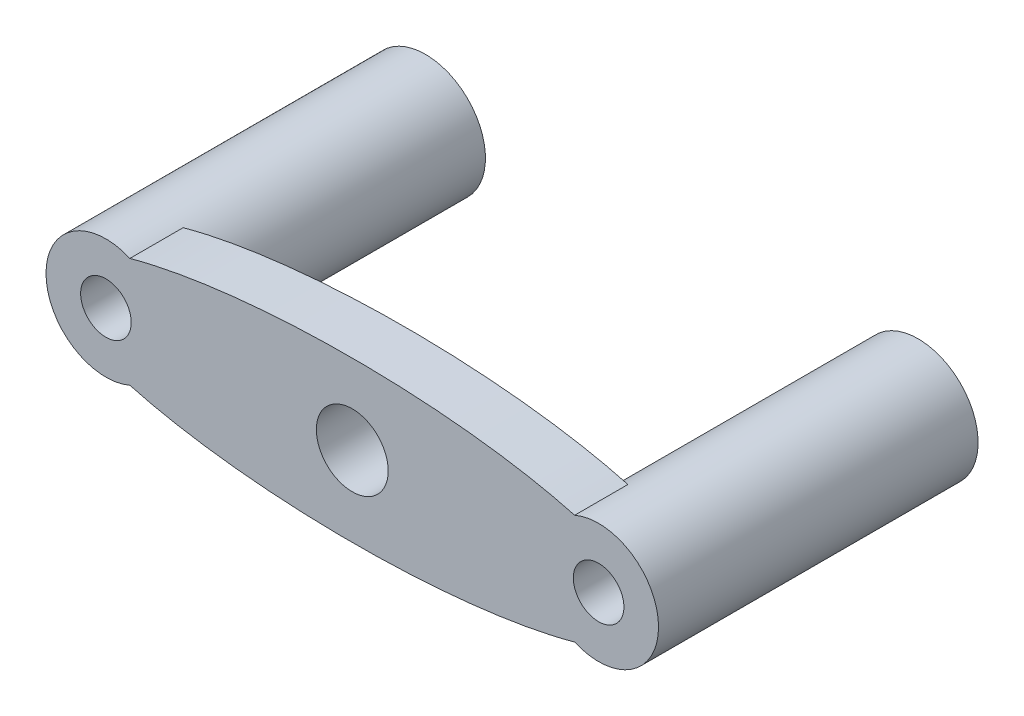
ISO-10303-21;
HEADER;
FILE_DESCRIPTION(('STEP AP214'),'2;1');
FILE_NAME('part.step','',(''),(''),'','','');
FILE_SCHEMA(('AUTOMOTIVE_DESIGN { 1 0 10303 214 1 1 1 1 }'));
ENDSEC;
DATA;
#1=APPLICATION_CONTEXT('core data for automotive mechanical design processes');
#2=APPLICATION_PROTOCOL_DEFINITION('international standard','automotive_design',2000,#1);
#3=PRODUCT_CONTEXT('',#1,'mechanical');
#4=PRODUCT('Part','Part','',(#3));
#5=PRODUCT_RELATED_PRODUCT_CATEGORY('part','',(#4));
#6=PRODUCT_DEFINITION_FORMATION('','',#4);
#7=PRODUCT_DEFINITION_CONTEXT('part definition',#1,'design');
#8=PRODUCT_DEFINITION('design','',#6,#7);
#9=PRODUCT_DEFINITION_SHAPE('','',#8);
#10=(LENGTH_UNIT() NAMED_UNIT(*) SI_UNIT(.MILLI.,.METRE.));
#11=(NAMED_UNIT(*) PLANE_ANGLE_UNIT() SI_UNIT($,.RADIAN.));
#12=(NAMED_UNIT(*) SI_UNIT($,.STERADIAN.) SOLID_ANGLE_UNIT());
#13=UNCERTAINTY_MEASURE_WITH_UNIT(LENGTH_MEASURE(1.E-05),#10,'distance_accuracy_value','');
#14=(GEOMETRIC_REPRESENTATION_CONTEXT(3) GLOBAL_UNCERTAINTY_ASSIGNED_CONTEXT((#13)) GLOBAL_UNIT_ASSIGNED_CONTEXT((#10,
#11,#12)) REPRESENTATION_CONTEXT('',''));
#15=CARTESIAN_POINT('',(0.,0.,0.));
#16=DIRECTION('',(0.,0.,1.));
#17=DIRECTION('',(1.,0.,0.));
#18=AXIS2_PLACEMENT_3D('',#15,#16,#17);
#19=CARTESIAN_POINT('',(0.,0.,0.));
#20=DIRECTION('',(0.,0.,1.));
#21=DIRECTION('',(1.,0.,0.));
#22=AXIS2_PLACEMENT_3D('',#19,#20,#21);
#23=PLANE('',#22);
#24=CARTESIAN_POINT('',(0.,0.,0.));
#25=DIRECTION('',(0.,0.,1.));
#26=DIRECTION('',(1.,0.,0.));
#27=AXIS2_PLACEMENT_3D('',#24,#25,#26);
#28=CIRCLE('',#27,3.429);
#29=CARTESIAN_POINT('',(3.429,0.,0.));
#30=VERTEX_POINT('',#29);
#31=EDGE_CURVE('E164',#30,#30,#28,.T.);
#32=ORIENTED_EDGE('',*,*,#31,.T.);
#33=EDGE_LOOP('',(#32));
#34=FACE_BOUND('',#33,.T.);
#35=CARTESIAN_POINT('',(-23.495,0.,0.));
#36=DIRECTION('',(0.,0.,-1.));
#37=DIRECTION('',(-1.,0.,0.));
#38=AXIS2_PLACEMENT_3D('',#35,#36,#37);
#39=CIRCLE('',#38,5.71499999999997);
#40=CARTESIAN_POINT('',(-21.2113184584179,5.23889526681311,0.));
#41=VERTEX_POINT('',#40);
#42=CARTESIAN_POINT('',(-21.2113184584179,-5.23889526681311,0.));
#43=VERTEX_POINT('',#42);
#44=EDGE_CURVE('E150',#41,#43,#39,.T.);
#45=ORIENTED_EDGE('',*,*,#44,.F.);
#46=CARTESIAN_POINT('',(0.,0.,0.));
#47=DIRECTION('',(0.,0.,1.));
#48=DIRECTION('',(1.,0.,0.));
#49=AXIS2_PLACEMENT_3D('',#46,#47,#48);
#50=ELLIPSE('',#49,29.21,7.62);
#51=CARTESIAN_POINT('',(21.2113184584179,5.23889526681311,0.));
#52=VERTEX_POINT('',#51);
#53=EDGE_CURVE('E71',#52,#41,#50,.T.);
#54=ORIENTED_EDGE('',*,*,#53,.F.);
#55=CARTESIAN_POINT('',(23.495,0.,0.));
#56=DIRECTION('',(0.,0.,-1.));
#57=DIRECTION('',(-1.,0.,0.));
#58=AXIS2_PLACEMENT_3D('',#55,#56,#57);
#59=CIRCLE('',#58,5.71499999999997);
#60=CARTESIAN_POINT('',(21.2113184584179,-5.23889526681311,0.));
#61=VERTEX_POINT('',#60);
#62=EDGE_CURVE('E11',#61,#52,#59,.T.);
#63=ORIENTED_EDGE('',*,*,#62,.F.);
#64=CARTESIAN_POINT('',(0.,0.,0.));
#65=DIRECTION('',(0.,0.,1.));
#66=DIRECTION('',(1.,0.,0.));
#67=AXIS2_PLACEMENT_3D('',#64,#65,#66);
#68=ELLIPSE('',#67,29.21,7.62);
#69=EDGE_CURVE('E171',#43,#61,#68,.T.);
#70=ORIENTED_EDGE('',*,*,#69,.F.);
#71=EDGE_LOOP('',(#45,#54,#63,#70));
#72=FACE_BOUND('',#71,.T.);
#73=ADVANCED_FACE('F33',(#34,#72),#23,.F.);
#74=CARTESIAN_POINT('',(0.,0.,5.08));
#75=DIRECTION('',(0.,0.,1.));
#76=DIRECTION('',(1.,0.,0.));
#77=AXIS2_PLACEMENT_3D('',#74,#75,#76);
#78=PLANE('',#77);
#79=CARTESIAN_POINT('',(0.,0.,5.08));
#80=DIRECTION('',(0.,0.,1.));
#81=DIRECTION('',(1.,0.,0.));
#82=AXIS2_PLACEMENT_3D('',#79,#80,#81);
#83=CIRCLE('',#82,3.429);
#84=CARTESIAN_POINT('',(3.429,0.,5.08));
#85=VERTEX_POINT('',#84);
#86=EDGE_CURVE('E165',#85,#85,#83,.T.);
#87=ORIENTED_EDGE('',*,*,#86,.F.);
#88=EDGE_LOOP('',(#87));
#89=FACE_BOUND('',#88,.T.);
#90=CARTESIAN_POINT('',(0.,0.,5.08));
#91=DIRECTION('',(0.,0.,1.));
#92=DIRECTION('',(1.,0.,0.));
#93=AXIS2_PLACEMENT_3D('',#90,#91,#92);
#94=ELLIPSE('',#93,29.21,7.62);
#95=CARTESIAN_POINT('',(-21.2113184584179,-5.23889526681311,5.08));
#96=VERTEX_POINT('',#95);
#97=CARTESIAN_POINT('',(21.2113184584179,-5.23889526681311,5.08));
#98=VERTEX_POINT('',#97);
#99=EDGE_CURVE('E85',#96,#98,#94,.T.);
#100=ORIENTED_EDGE('',*,*,#99,.T.);
#101=CARTESIAN_POINT('',(23.495,0.,5.08));
#102=DIRECTION('',(0.,0.,1.));
#103=DIRECTION('',(1.,0.,0.));
#104=AXIS2_PLACEMENT_3D('',#101,#102,#103);
#105=CIRCLE('',#104,5.71499999999997);
#106=CARTESIAN_POINT('',(21.2113184584179,5.23889526681311,5.08));
#107=VERTEX_POINT('',#106);
#108=EDGE_CURVE('E77',#98,#107,#105,.T.);
#109=ORIENTED_EDGE('',*,*,#108,.T.);
#110=CARTESIAN_POINT('',(0.,0.,5.08));
#111=DIRECTION('',(0.,0.,1.));
#112=DIRECTION('',(1.,0.,0.));
#113=AXIS2_PLACEMENT_3D('',#110,#111,#112);
#114=ELLIPSE('',#113,29.21,7.62);
#115=CARTESIAN_POINT('',(-21.2113184584179,5.23889526681311,5.08));
#116=VERTEX_POINT('',#115);
#117=EDGE_CURVE('E82',#107,#116,#114,.T.);
#118=ORIENTED_EDGE('',*,*,#117,.T.);
#119=CARTESIAN_POINT('',(-23.495,0.,5.08));
#120=DIRECTION('',(0.,0.,1.));
#121=DIRECTION('',(1.,0.,0.));
#122=AXIS2_PLACEMENT_3D('',#119,#120,#121);
#123=CIRCLE('',#122,5.71499999999997);
#124=EDGE_CURVE('E53',#116,#96,#123,.T.);
#125=ORIENTED_EDGE('',*,*,#124,.T.);
#126=EDGE_LOOP('',(#100,#109,#118,#125));
#127=FACE_BOUND('',#126,.T.);
#128=CARTESIAN_POINT('',(-23.495,0.,5.08));
#129=DIRECTION('',(0.,0.,1.));
#130=DIRECTION('',(1.,0.,0.));
#131=AXIS2_PLACEMENT_3D('',#128,#129,#130);
#132=CIRCLE('',#131,2.413);
#133=CARTESIAN_POINT('',(-21.082,0.,5.08));
#134=VERTEX_POINT('',#133);
#135=EDGE_CURVE('E168',#134,#134,#132,.T.);
#136=ORIENTED_EDGE('',*,*,#135,.F.);
#137=EDGE_LOOP('',(#136));
#138=FACE_BOUND('',#137,.T.);
#139=CARTESIAN_POINT('',(23.495,0.,5.08));
#140=DIRECTION('',(0.,0.,1.));
#141=DIRECTION('',(1.,0.,0.));
#142=AXIS2_PLACEMENT_3D('',#139,#140,#141);
#143=CIRCLE('',#142,2.413);
#144=CARTESIAN_POINT('',(25.908,0.,5.08));
#145=VERTEX_POINT('',#144);
#146=EDGE_CURVE('E161',#145,#145,#143,.T.);
#147=ORIENTED_EDGE('',*,*,#146,.F.);
#148=EDGE_LOOP('',(#147));
#149=FACE_BOUND('',#148,.T.);
#150=ADVANCED_FACE('F79',(#89,#127,#138,#149),#78,.T.);
#151=DIRECTION('',(0.,0.,-1.));
#152=VECTOR('',#151,1.);
#153=SURFACE_OF_LINEAR_EXTRUSION('',#94,#152);
#154=ORIENTED_EDGE('',*,*,#69,.T.);
#155=DIRECTION('',(0.,0.,-1.));
#156=VECTOR('',#155,1.);
#157=CARTESIAN_POINT('',(21.2113184584179,-5.23889526681311,5.08));
#158=LINE('',#157,#156);
#159=EDGE_CURVE('E44',#98,#61,#158,.T.);
#160=ORIENTED_EDGE('',*,*,#159,.F.);
#161=ORIENTED_EDGE('',*,*,#99,.F.);
#162=DIRECTION('',(0.,0.,-1.));
#163=VECTOR('',#162,1.);
#164=CARTESIAN_POINT('',(-21.2113184584179,-5.23889526681311,5.08));
#165=LINE('',#164,#163);
#166=EDGE_CURVE('E98',#96,#43,#165,.T.);
#167=ORIENTED_EDGE('',*,*,#166,.T.);
#168=EDGE_LOOP('',(#154,#160,#161,#167));
#169=FACE_BOUND('',#168,.T.);
#170=ADVANCED_FACE('F35',(#169),#153,.F.);
#171=CARTESIAN_POINT('',(23.495,0.,5.08));
#172=DIRECTION('',(0.,0.,-1.));
#173=DIRECTION('',(-1.,0.,0.));
#174=AXIS2_PLACEMENT_3D('',#171,#172,#173);
#175=CYLINDRICAL_SURFACE('',#174,5.71499999999997);
#176=ORIENTED_EDGE('',*,*,#159,.T.);
#177=ORIENTED_EDGE('',*,*,#62,.T.);
#178=DIRECTION('',(0.,0.,-1.));
#179=VECTOR('',#178,1.);
#180=CARTESIAN_POINT('',(21.2113184584179,5.23889526681311,5.08));
#181=LINE('',#180,#179);
#182=EDGE_CURVE('E89',#107,#52,#181,.T.);
#183=ORIENTED_EDGE('',*,*,#182,.F.);
#184=ORIENTED_EDGE('',*,*,#108,.F.);
#185=EDGE_LOOP('',(#176,#177,#183,#184));
#186=FACE_BOUND('',#185,.T.);
#187=CARTESIAN_POINT('',(23.495,0.,-25.4));
#188=DIRECTION('',(0.,0.,-1.));
#189=DIRECTION('',(-1.,0.,0.));
#190=AXIS2_PLACEMENT_3D('',#187,#188,#189);
#191=CIRCLE('',#190,5.71499999999997);
#192=CARTESIAN_POINT('',(17.78,0.,-25.4));
#193=VERTEX_POINT('',#192);
#194=EDGE_CURVE('E158',#193,#193,#191,.T.);
#195=ORIENTED_EDGE('',*,*,#194,.F.);
#196=EDGE_LOOP('',(#195));
#197=FACE_BOUND('',#196,.T.);
#198=ADVANCED_FACE('F90',(#186,#197),#175,.T.);
#199=DIRECTION('',(0.,0.,-1.));
#200=VECTOR('',#199,1.);
#201=SURFACE_OF_LINEAR_EXTRUSION('',#114,#200);
#202=ORIENTED_EDGE('',*,*,#53,.T.);
#203=DIRECTION('',(0.,0.,-1.));
#204=VECTOR('',#203,1.);
#205=CARTESIAN_POINT('',(-21.2113184584179,5.23889526681311,5.08));
#206=LINE('',#205,#204);
#207=EDGE_CURVE('E93',#116,#41,#206,.T.);
#208=ORIENTED_EDGE('',*,*,#207,.F.);
#209=ORIENTED_EDGE('',*,*,#117,.F.);
#210=ORIENTED_EDGE('',*,*,#182,.T.);
#211=EDGE_LOOP('',(#202,#208,#209,#210));
#212=FACE_BOUND('',#211,.T.);
#213=ADVANCED_FACE('F95',(#212),#201,.F.);
#214=CARTESIAN_POINT('',(-23.495,0.,5.08));
#215=DIRECTION('',(0.,0.,-1.));
#216=DIRECTION('',(-1.,0.,0.));
#217=AXIS2_PLACEMENT_3D('',#214,#215,#216);
#218=CYLINDRICAL_SURFACE('',#217,5.71499999999997);
#219=ORIENTED_EDGE('',*,*,#207,.T.);
#220=ORIENTED_EDGE('',*,*,#44,.T.);
#221=ORIENTED_EDGE('',*,*,#166,.F.);
#222=ORIENTED_EDGE('',*,*,#124,.F.);
#223=EDGE_LOOP('',(#219,#220,#221,#222));
#224=FACE_BOUND('',#223,.T.);
#225=CARTESIAN_POINT('',(-23.495,0.,-25.4));
#226=DIRECTION('',(0.,0.,-1.));
#227=DIRECTION('',(-1.,0.,0.));
#228=AXIS2_PLACEMENT_3D('',#225,#226,#227);
#229=CIRCLE('',#228,5.71499999999997);
#230=CARTESIAN_POINT('',(-29.21,0.,-25.4));
#231=VERTEX_POINT('',#230);
#232=EDGE_CURVE('E145',#231,#231,#229,.T.);
#233=ORIENTED_EDGE('',*,*,#232,.F.);
#234=EDGE_LOOP('',(#233));
#235=FACE_BOUND('',#234,.T.);
#236=ADVANCED_FACE('F105',(#224,#235),#218,.T.);
#237=CARTESIAN_POINT('',(-23.495,0.,5.08));
#238=DIRECTION('',(0.,0.,-1.));
#239=DIRECTION('',(-1.,0.,0.));
#240=AXIS2_PLACEMENT_3D('',#237,#238,#239);
#241=CYLINDRICAL_SURFACE('',#240,2.413);
#242=ORIENTED_EDGE('',*,*,#135,.T.);
#243=EDGE_LOOP('',(#242));
#244=FACE_BOUND('',#243,.T.);
#245=CARTESIAN_POINT('',(-23.495,0.,-25.4));
#246=DIRECTION('',(0.,0.,-1.));
#247=DIRECTION('',(-1.,0.,0.));
#248=AXIS2_PLACEMENT_3D('',#245,#246,#247);
#249=CIRCLE('',#248,2.413);
#250=CARTESIAN_POINT('',(-25.908,0.,-25.4));
#251=VERTEX_POINT('',#250);
#252=EDGE_CURVE('E148',#251,#251,#249,.T.);
#253=ORIENTED_EDGE('',*,*,#252,.T.);
#254=EDGE_LOOP('',(#253));
#255=FACE_BOUND('',#254,.T.);
#256=ADVANCED_FACE('F121',(#244,#255),#241,.F.);
#257=CARTESIAN_POINT('',(0.,0.,5.08));
#258=DIRECTION('',(0.,0.,-1.));
#259=DIRECTION('',(-1.,0.,0.));
#260=AXIS2_PLACEMENT_3D('',#257,#258,#259);
#261=CYLINDRICAL_SURFACE('',#260,3.429);
#262=ORIENTED_EDGE('',*,*,#86,.T.);
#263=EDGE_LOOP('',(#262));
#264=FACE_BOUND('',#263,.T.);
#265=ORIENTED_EDGE('',*,*,#31,.F.);
#266=EDGE_LOOP('',(#265));
#267=FACE_BOUND('',#266,.T.);
#268=ADVANCED_FACE('F124',(#264,#267),#261,.F.);
#269=CARTESIAN_POINT('',(23.495,0.,5.08));
#270=DIRECTION('',(0.,0.,-1.));
#271=DIRECTION('',(-1.,0.,0.));
#272=AXIS2_PLACEMENT_3D('',#269,#270,#271);
#273=CYLINDRICAL_SURFACE('',#272,2.413);
#274=ORIENTED_EDGE('',*,*,#146,.T.);
#275=EDGE_LOOP('',(#274));
#276=FACE_BOUND('',#275,.T.);
#277=CARTESIAN_POINT('',(23.495,0.,-25.4));
#278=DIRECTION('',(0.,0.,-1.));
#279=DIRECTION('',(-1.,0.,0.));
#280=AXIS2_PLACEMENT_3D('',#277,#278,#279);
#281=CIRCLE('',#280,2.413);
#282=CARTESIAN_POINT('',(21.082,0.,-25.4));
#283=VERTEX_POINT('',#282);
#284=EDGE_CURVE('E154',#283,#283,#281,.T.);
#285=ORIENTED_EDGE('',*,*,#284,.T.);
#286=EDGE_LOOP('',(#285));
#287=FACE_BOUND('',#286,.T.);
#288=ADVANCED_FACE('F128',(#276,#287),#273,.F.);
#289=CARTESIAN_POINT('',(23.495,0.,-25.4));
#290=DIRECTION('',(0.,0.,-1.));
#291=DIRECTION('',(-1.,0.,0.));
#292=AXIS2_PLACEMENT_3D('',#289,#290,#291);
#293=PLANE('',#292);
#294=ORIENTED_EDGE('',*,*,#194,.T.);
#295=EDGE_LOOP('',(#294));
#296=FACE_BOUND('',#295,.T.);
#297=ORIENTED_EDGE('',*,*,#284,.F.);
#298=EDGE_LOOP('',(#297));
#299=FACE_BOUND('',#298,.T.);
#300=ADVANCED_FACE('F132',(#296,#299),#293,.T.);
#301=CARTESIAN_POINT('',(-23.495,0.,-25.4));
#302=DIRECTION('',(0.,0.,-1.));
#303=DIRECTION('',(-1.,0.,0.));
#304=AXIS2_PLACEMENT_3D('',#301,#302,#303);
#305=PLANE('',#304);
#306=ORIENTED_EDGE('',*,*,#232,.T.);
#307=EDGE_LOOP('',(#306));
#308=FACE_BOUND('',#307,.T.);
#309=ORIENTED_EDGE('',*,*,#252,.F.);
#310=EDGE_LOOP('',(#309));
#311=FACE_BOUND('',#310,.T.);
#312=ADVANCED_FACE('F136',(#308,#311),#305,.T.);
#313=CLOSED_SHELL('',(#73,#150,#170,#198,#213,#236,#256,#268,#288,#300,#312));
#314=MANIFOLD_SOLID_BREP('B2',#313);
#315=ADVANCED_BREP_SHAPE_REPRESENTATION('',(#18,#314),#14);
#316=SHAPE_DEFINITION_REPRESENTATION(#9,#315);
ENDSEC;
END-ISO-10303-21;
